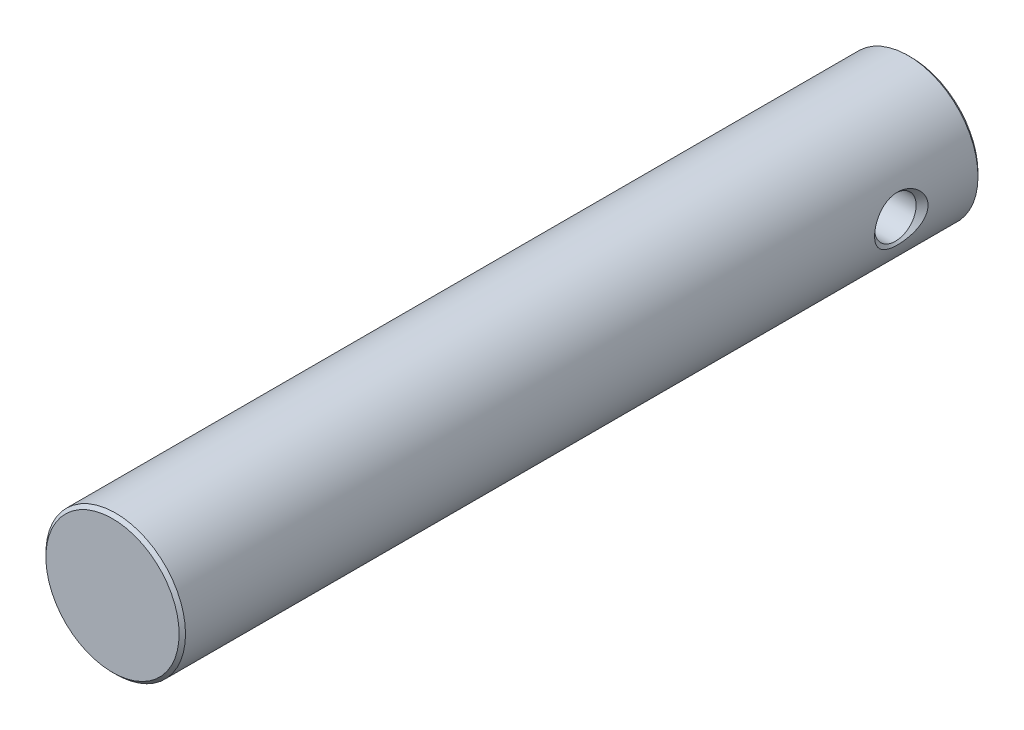
ISO-10303-21;
HEADER;
FILE_DESCRIPTION(('STEP AP214'),'2;1');
FILE_NAME('part.step','',(''),(''),'','','');
FILE_SCHEMA(('AUTOMOTIVE_DESIGN { 1 0 10303 214 1 1 1 1 }'));
ENDSEC;
DATA;
#1=APPLICATION_CONTEXT('core data for automotive mechanical design processes');
#2=APPLICATION_PROTOCOL_DEFINITION('international standard','automotive_design',2000,#1);
#3=PRODUCT_CONTEXT('',#1,'mechanical');
#4=PRODUCT('Part','Part','',(#3));
#5=PRODUCT_RELATED_PRODUCT_CATEGORY('part','',(#4));
#6=PRODUCT_DEFINITION_FORMATION('','',#4);
#7=PRODUCT_DEFINITION_CONTEXT('part definition',#1,'design');
#8=PRODUCT_DEFINITION('design','',#6,#7);
#9=PRODUCT_DEFINITION_SHAPE('','',#8);
#10=(LENGTH_UNIT() NAMED_UNIT(*) SI_UNIT(.MILLI.,.METRE.));
#11=(NAMED_UNIT(*) PLANE_ANGLE_UNIT() SI_UNIT($,.RADIAN.));
#12=(NAMED_UNIT(*) SI_UNIT($,.STERADIAN.) SOLID_ANGLE_UNIT());
#13=UNCERTAINTY_MEASURE_WITH_UNIT(LENGTH_MEASURE(1.E-05),#10,'distance_accuracy_value','');
#14=(GEOMETRIC_REPRESENTATION_CONTEXT(3) GLOBAL_UNCERTAINTY_ASSIGNED_CONTEXT((#13)) GLOBAL_UNIT_ASSIGNED_CONTEXT((#10,
#11,#12)) REPRESENTATION_CONTEXT('',''));
#15=CARTESIAN_POINT('',(0.,0.,0.));
#16=DIRECTION('',(0.,0.,1.));
#17=DIRECTION('',(1.,0.,0.));
#18=AXIS2_PLACEMENT_3D('',#15,#16,#17);
#19=CARTESIAN_POINT('',(0.,0.,-31.75));
#20=DIRECTION('',(0.,0.,1.));
#21=DIRECTION('',(1.,0.,0.));
#22=AXIS2_PLACEMENT_3D('',#19,#20,#21);
#23=CYLINDRICAL_SURFACE('',#22,5.5499);
#24=CARTESIAN_POINT('',(0.,-5.5499,14.2748));
#25=CARTESIAN_POINT('',(0.0988542584628955,-5.54989909986941,14.274800944377));
#26=CARTESIAN_POINT('',(0.197744021132447,-5.5472518584646,14.2784596493677));
#27=CARTESIAN_POINT('',(0.39475030264655,-5.53672353539861,14.2930386515627));
#28=CARTESIAN_POINT('',(0.492866252837972,-5.52883891254603,14.3039638619322));
#29=CARTESIAN_POINT('',(0.687718107793937,-5.5079985260747,14.3329355871665));
#30=CARTESIAN_POINT('',(0.784450593813109,-5.49503190124282,14.3509973549009));
#31=CARTESIAN_POINT('',(0.975627683931618,-5.46433324991178,14.3939604773847));
#32=CARTESIAN_POINT('',(1.070071244772,-5.44659909337088,14.4188648894063));
#33=CARTESIAN_POINT('',(1.34780913542737,-5.38705696081635,14.502982271891));
#34=CARTESIAN_POINT('',(1.52691208431064,-5.33875110287644,14.5718144614485));
#35=CARTESIAN_POINT('',(1.86985166359377,-5.22853596625687,14.7319717817279));
#36=CARTESIAN_POINT('',(2.03369406844376,-5.16663186305154,14.8232883565165));
#37=CARTESIAN_POINT('',(2.35851306333458,-5.02720489734093,15.0346839794055));
#38=CARTESIAN_POINT('',(2.51788456364778,-4.94877502943443,15.1566195619126));
#39=CARTESIAN_POINT('',(2.81537610405895,-4.78579690491205,15.4210950304568));
#40=CARTESIAN_POINT('',(2.95346148489604,-4.7012389925521,15.5636678024224));
#41=CARTESIAN_POINT('',(3.1556630008805,-4.56633574956764,15.8057846684316));
#42=CARTESIAN_POINT('',(3.22707834612859,-4.516011968461,15.8993528998113));
#43=CARTESIAN_POINT('',(3.36174617806854,-4.41667807584223,16.0929271750348));
#44=CARTESIAN_POINT('',(3.42499637481465,-4.36766833589789,16.1929350131546));
#45=CARTESIAN_POINT('',(3.54285314014363,-4.27262293131192,16.3990757618303));
#46=CARTESIAN_POINT('',(3.59747152455169,-4.22658325307483,16.5052000232303));
#47=CARTESIAN_POINT('',(3.69763184204563,-4.1392416860651,16.7234780882721));
#48=CARTESIAN_POINT('',(3.74317527056043,-4.09793901717482,16.8356308946178));
#49=CARTESIAN_POINT('',(3.83855480007141,-4.00905228763887,17.1055636236187));
#50=CARTESIAN_POINT('',(3.88445168028566,-3.96421669439769,17.2657366320368));
#51=CARTESIAN_POINT('',(3.93834985305575,-3.91042566184026,17.5119558875052));
#52=CARTESIAN_POINT('',(3.95382045998245,-3.89474380936618,17.5949765512204));
#53=CARTESIAN_POINT('',(3.97956164714028,-3.86843906801129,17.762604263144));
#54=CARTESIAN_POINT('',(3.98983432457849,-3.85781413891801,17.8472106572466));
#55=CARTESIAN_POINT('',(4.00503549216036,-3.84203109843311,18.0180474851989));
#56=CARTESIAN_POINT('',(4.00992399182666,-3.8369139015043,18.1042852958025));
#57=CARTESIAN_POINT('',(4.01411493889475,-3.83252931734454,18.2770452449626));
#58=CARTESIAN_POINT('',(4.01341757949694,-3.83326172779081,18.3635673735817));
#59=CARTESIAN_POINT('',(4.0064506376884,-3.84054266235966,18.5361774965497));
#60=CARTESIAN_POINT('',(4.00017849788727,-3.84709385580612,18.6222652734128));
#61=CARTESIAN_POINT('',(3.98219127656686,-3.86570932029536,18.7932999410377));
#62=CARTESIAN_POINT('',(3.97047337983136,-3.87777644277717,18.878246218297));
#63=CARTESIAN_POINT('',(3.94011055778005,-3.90863655305994,19.0563784428082));
#64=CARTESIAN_POINT('',(3.92080769937962,-3.92805862076943,19.1493432766045));
#65=CARTESIAN_POINT('',(3.87604137655076,-3.97223912897917,19.3325007531704));
#66=CARTESIAN_POINT('',(3.85057377377293,-3.9970011529309,19.4226914876747));
#67=CARTESIAN_POINT('',(3.76541570153038,-4.07788392863067,19.6887526346269));
#68=CARTESIAN_POINT('',(3.69700232179894,-4.14056622861344,19.8599288576933));
#69=CARTESIAN_POINT('',(3.56609682480957,-4.25313017200406,20.1328202827925));
#70=CARTESIAN_POINT('',(3.50931778754628,-4.30025160544126,20.2385731129106));
#71=CARTESIAN_POINT('',(3.38713184418136,-4.39713550310313,20.4437731255054));
#72=CARTESIAN_POINT('',(3.32172269463881,-4.44689865203774,20.5432186583811));
#73=CARTESIAN_POINT('',(3.1825938157913,-4.54751221164715,20.7356489468278));
#74=CARTESIAN_POINT('',(3.10886730465102,-4.59836348178154,20.8286283286979));
#75=CARTESIAN_POINT('',(2.95337964365325,-4.69973965701643,21.007814513648));
#76=CARTESIAN_POINT('',(2.87161815067056,-4.75026454808098,21.0940210272169));
#77=CARTESIAN_POINT('',(2.69925042513856,-4.85030755508015,21.2602591841581));
#78=CARTESIAN_POINT('',(2.60855130624872,-4.89980678685218,21.3402060759225));
#79=CARTESIAN_POINT('',(2.41937491257623,-4.99592552449282,21.4922349969848));
#80=CARTESIAN_POINT('',(2.32089870179697,-5.04254542274037,21.564318098945));
#81=CARTESIAN_POINT('',(2.11665181287464,-5.13162312103817,21.6998238316032));
#82=CARTESIAN_POINT('',(2.01089477461595,-5.17408836138038,21.7632620270243));
#83=CARTESIAN_POINT('',(1.79249305484912,-5.2537494320948,21.8807884800441));
#84=CARTESIAN_POINT('',(1.6798509903082,-5.29094724697889,21.9348802606216));
#85=CARTESIAN_POINT('',(1.39192633641222,-5.37550136432577,22.0567095746757));
#86=CARTESIAN_POINT('',(1.21281047063183,-5.41900626761304,22.1182990144332));
#87=CARTESIAN_POINT('',(0.844564846909833,-5.48845754796403,22.2159420107817));
#88=CARTESIAN_POINT('',(0.655442549899065,-5.51441681377834,22.2520143127725));
#89=CARTESIAN_POINT('',(0.271580440119159,-5.54660432288356,22.2966719065854));
#90=CARTESIAN_POINT('',(0.0768233695225006,-5.55276359145286,22.3051611117964));
#91=CARTESIAN_POINT('',(-0.311427606468222,-5.54455684607664,22.2938095233789));
#92=CARTESIAN_POINT('',(-0.504921429237453,-5.53018950280081,22.2739668949438));
#93=CARTESIAN_POINT('',(-0.874454762639378,-5.48357367867249,22.2090248971509));
#94=CARTESIAN_POINT('',(-1.05087441712138,-5.45232196756823,22.165332156403));
#95=CARTESIAN_POINT('',(-1.39324914866746,-5.37504244161861,22.0558857586081));
#96=CARTESIAN_POINT('',(-1.559202059502,-5.32901157996283,21.9901275525071));
#97=CARTESIAN_POINT('',(-1.89165332423962,-5.2207451139705,21.832590820731));
#98=CARTESIAN_POINT('',(-2.05697158009923,-5.15745645898042,21.7390610957695));
#99=CARTESIAN_POINT('',(-2.37016352064494,-5.02124851328564,21.5319797428113));
#100=CARTESIAN_POINT('',(-2.51802483245185,-4.94832246860068,21.4184140545355));
#101=CARTESIAN_POINT('',(-2.82051998340972,-4.78339459538117,21.1512646636168));
#102=CARTESIAN_POINT('',(-2.97147042542011,-4.69033947945335,20.9941599602924));
#103=CARTESIAN_POINT('',(-3.24632307325338,-4.50447449482305,20.6574819724768));
#104=CARTESIAN_POINT('',(-3.3702057999097,-4.41166484991227,20.4778926522689));
#105=CARTESIAN_POINT('',(-3.57437937549706,-4.24735586993741,20.1226170570111));
#106=CARTESIAN_POINT('',(-3.65827016904424,-4.17466198503174,19.9495622350248));
#107=CARTESIAN_POINT('',(-3.80164913566819,-4.04453285891094,19.5883124357241));
#108=CARTESIAN_POINT('',(-3.86118859213625,-3.98706564155013,19.400150285047));
#109=CARTESIAN_POINT('',(-3.94309896125019,-3.90589386132974,19.051454075068));
#110=CARTESIAN_POINT('',(-3.97059771535183,-3.87767467617476,18.8932045605753));
#111=CARTESIAN_POINT('',(-4.00635298469629,-3.84073302564279,18.5723766266053));
#112=CARTESIAN_POINT('',(-4.01463507946308,-3.83198464308241,18.4098042534174));
#113=CARTESIAN_POINT('',(-4.01135350478794,-3.83541825974806,18.0849292539801));
#114=CARTESIAN_POINT('',(-3.99976965375334,-3.84762154355225,17.9226270699045));
#115=CARTESIAN_POINT('',(-3.95760708300469,-3.8909645912754,17.6030145692194));
#116=CARTESIAN_POINT('',(-3.92699848353486,-3.92213414147838,17.445712514966));
#117=CARTESIAN_POINT('',(-3.83613536286259,-4.01131331124118,17.090835299189));
#118=CARTESIAN_POINT('',(-3.76956610553841,-4.07469405833083,16.896259086088));
#119=CARTESIAN_POINT('',(-3.61041709375455,-4.21634977903148,16.5239612241513));
#120=CARTESIAN_POINT('',(-3.51779366264744,-4.29464969107614,16.3462685534829));
#121=CARTESIAN_POINT('',(-3.30600752038752,-4.45985279020995,16.0037563030462));
#122=CARTESIAN_POINT('',(-3.18616041794617,-4.54693820404395,15.8394514656539));
#123=CARTESIAN_POINT('',(-2.92281130702149,-4.72053310680361,15.5304404487209));
#124=CARTESIAN_POINT('',(-2.77930022834999,-4.80704236161344,15.3857418229562));
#125=CARTESIAN_POINT('',(-2.53146209291151,-4.94007027443387,15.171492566076));
#126=CARTESIAN_POINT('',(-2.43427593732761,-4.98880046498551,15.0949556948391));
#127=CARTESIAN_POINT('',(-2.23204817944987,-5.08249435213028,14.950461160733));
#128=CARTESIAN_POINT('',(-2.12701010007382,-5.12745971891306,14.8824996867005));
#129=CARTESIAN_POINT('',(-1.90957819908447,-5.2123427429723,14.7559898164576));
#130=CARTESIAN_POINT('',(-1.79718943395093,-5.25226381589277,14.6974350433151));
#131=CARTESIAN_POINT('',(-1.56569547144015,-5.32585346341179,14.5906227167325));
#132=CARTESIAN_POINT('',(-1.44659382991463,-5.35952530843067,14.542359775267));
#133=CARTESIAN_POINT('',(-1.23729808008295,-5.41096890092587,14.4691733356683));
#134=CARTESIAN_POINT('',(-1.14849211758806,-5.43054113607316,14.4415132522572));
#135=CARTESIAN_POINT('',(-0.968416235918972,-5.46552508374404,14.3922780198637));
#136=CARTESIAN_POINT('',(-0.877146940431933,-5.48093783872867,14.3707013461786));
#137=CARTESIAN_POINT('',(-0.692941384882553,-5.50725504094046,14.3339633370566));
#138=CARTESIAN_POINT('',(-0.600010118119875,-5.51817119277971,14.3187853434729));
#139=CARTESIAN_POINT('',(-0.412918736977421,-5.5353140125568,14.2949868210681));
#140=CARTESIAN_POINT('',(-0.318759371259146,-5.5415434130513,14.2863624711906));
#141=CARTESIAN_POINT('',(-0.187012416860984,-5.54687438395354,14.2789850352275));
#142=CARTESIAN_POINT('',(-0.149640149707313,-5.54800834172257,14.2774163329913));
#143=CARTESIAN_POINT('',(-0.0748469548506951,-5.54952136447578,14.275323575254));
#144=CARTESIAN_POINT('',(-0.0374260219483874,-5.54990034078762,14.2747996424608));
#145=CARTESIAN_POINT('',(0.,-5.5499,14.2748));
#146=B_SPLINE_CURVE_WITH_KNOTS('',3,(#24,#25,#26,#27,#28,#29,#30,#31,#32,#33,#34,#35,#36,#37,
#38,#39,#40,#41,#42,#43,#44,#45,#46,#47,#48,#49,#50,#51,#52,#53,#54,#55,#56,#57,#58,#59,#60,#61,
#62,#63,#64,#65,#66,#67,#68,#69,#70,#71,#72,#73,#74,#75,#76,#77,#78,#79,#80,#81,#82,#83,#84,#85,
#86,#87,#88,#89,#90,#91,#92,#93,#94,#95,#96,#97,#98,#99,#100,#101,#102,#103,#104,#105,#106,#107,
#108,#109,#110,#111,#112,#113,#114,#115,#116,#117,#118,#119,#120,#121,#122,#123,#124,#125,#126,
#127,#128,#129,#130,#131,#132,#133,#134,#135,#136,#137,#138,#139,#140,#141,#142,#143,#144,#145),
.UNSPECIFIED.,.T.,.F.,(4,2,2,2,2,2,2,2,2,2,2,2,2,2,2,2,2,2,2,2,2,2,2,2,2,2,2,2,2,2,2,2,2,2,2,2,
2,2,2,2,2,2,2,2,2,2,2,2,2,2,2,2,2,2,2,2,2,2,2,2,4),(0.,0.296521574776071,0.593243843342591,
0.890603753006894,1.18809673880865,1.77885849847819,2.36939580336754,3.01344611735805,
3.65853427865239,4.04221064201519,4.42599437612411,4.80924812288612,5.19243866233522,
5.70782126896884,5.96523904642418,6.22255288062312,6.48176526391517,6.74096868176122,
7.00029106871723,7.25974766328952,7.55005162633002,7.84055101146711,8.42211051405519,
8.80857081902133,9.19513178494655,9.58201025586363,9.96890525519256,10.3603601828925,
10.7517616471358,11.1424488295771,11.5329884260675,12.1133670512671,12.6933188747036,
13.2752888252278,13.8572964665977,14.4081964935623,14.9592101648693,15.5576035017297,
16.1564184448791,16.8644495623267,17.5729885452968,18.1877160164013,18.801142134598,
19.288312180541,19.7748333756878,20.2618491151148,20.7496316878477,21.3916993917568,
22.0348499250643,22.6964287904467,23.3582618249916,23.7566552170161,24.1548709227453,
24.5528155228779,24.950551275017,25.2354161283391,25.5202095215596,25.804256843243,
26.0881384257782,26.2003877102874,26.3126501776641),.UNSPECIFIED.);
#147=CARTESIAN_POINT('',(0.,-5.5499,14.2748));
#148=VERTEX_POINT('',#147);
#149=EDGE_CURVE('E11',#148,#148,#146,.T.);
#150=ORIENTED_EDGE('',*,*,#149,.F.);
#151=EDGE_LOOP('',(#150));
#152=FACE_BOUND('',#151,.T.);
#153=CARTESIAN_POINT('',(0.,0.,31.496));
#154=DIRECTION('',(0.,0.,1.));
#155=DIRECTION('',(1.,0.,0.));
#156=AXIS2_PLACEMENT_3D('',#153,#154,#155);
#157=CIRCLE('',#156,5.5499);
#158=CARTESIAN_POINT('',(5.5499,0.,31.496));
#159=VERTEX_POINT('',#158);
#160=EDGE_CURVE('E27',#159,#159,#157,.F.);
#161=ORIENTED_EDGE('',*,*,#160,.T.);
#162=EDGE_LOOP('',(#161));
#163=FACE_BOUND('',#162,.T.);
#164=CARTESIAN_POINT('',(0.,0.,-31.496));
#165=DIRECTION('',(0.,0.,1.));
#166=DIRECTION('',(1.,0.,0.));
#167=AXIS2_PLACEMENT_3D('',#164,#165,#166);
#168=CIRCLE('',#167,5.5499);
#169=CARTESIAN_POINT('',(5.5499,0.,-31.496));
#170=VERTEX_POINT('',#169);
#171=EDGE_CURVE('E54',#170,#170,#168,.T.);
#172=ORIENTED_EDGE('',*,*,#171,.T.);
#173=EDGE_LOOP('',(#172));
#174=FACE_BOUND('',#173,.T.);
#175=CARTESIAN_POINT('',(5.35379022939372,-1.46229962375991,-26.6566786446898));
#176=CARTESIAN_POINT('',(5.33549327363893,-1.52929619797754,-26.5506362719607));
#177=CARTESIAN_POINT('',(5.31833083866429,-1.58723207768655,-26.438464771529));
#178=CARTESIAN_POINT('',(5.28840888501346,-1.68425574927919,-26.2054600936719));
#179=CARTESIAN_POINT('',(5.27566213057231,-1.72328902746247,-26.084603005226));
#180=CARTESIAN_POINT('',(5.25613793004653,-1.78195669587375,-25.8373192664702));
#181=CARTESIAN_POINT('',(5.24938197872293,-1.80152126357239,-25.7108742561494));
#182=CARTESIAN_POINT('',(5.24277073596635,-1.82067302337714,-25.4564133528529));
#183=CARTESIAN_POINT('',(5.24290992741283,-1.8202761875155,-25.3283987977439));
#184=CARTESIAN_POINT('',(5.2501263859595,-1.79935763626881,-25.0717471466724));
#185=CARTESIAN_POINT('',(5.25733623415469,-1.77845134795399,-24.9431449317666));
#186=CARTESIAN_POINT('',(5.27796710887384,-1.71625085821309,-24.6913882195294));
#187=CARTESIAN_POINT('',(5.29139239845373,-1.67494266219576,-24.5682375249131));
#188=CARTESIAN_POINT('',(5.32271973392227,-1.57254616815927,-24.3312536183247));
#189=CARTESIAN_POINT('',(5.34061545791379,-1.51148576719846,-24.2174075473577));
#190=CARTESIAN_POINT('',(5.37858911287341,-1.37021745352902,-24.002705431944));
#191=CARTESIAN_POINT('',(5.39866473097481,-1.29002972882518,-23.9018358630342));
#192=CARTESIAN_POINT('',(5.43393726311979,-1.13085660452914,-23.7374449001199));
#193=CARTESIAN_POINT('',(5.44925050038109,-1.05536004154897,-23.6705638346178));
#194=CARTESIAN_POINT('',(5.47801500349811,-0.894108777405574,-23.5499982825102));
#195=CARTESIAN_POINT('',(5.49146733669441,-0.808360009560677,-23.496306217394));
#196=CARTESIAN_POINT('',(5.51507075182213,-0.627494991354507,-23.404511746994));
#197=CARTESIAN_POINT('',(5.52519467771054,-0.532309550466073,-23.3665369577378));
#198=CARTESIAN_POINT('',(5.54058580391635,-0.336058172327269,-23.3095002335432));
#199=CARTESIAN_POINT('',(5.54585825551444,-0.234998719477542,-23.2904178475886));
#200=CARTESIAN_POINT('',(5.55041545718603,-0.0451086707256445,-23.2739219000482));
#201=CARTESIAN_POINT('',(5.55042659968706,0.0434832081315005,-23.2738796428403));
#202=CARTESIAN_POINT('',(5.54626346651213,0.219251673509871,-23.288952916722));
#203=CARTESIAN_POINT('',(5.54208994296223,0.306428511500549,-23.3040657239339));
#204=CARTESIAN_POINT('',(5.53033990961621,0.472591831216115,-23.3473963576569));
#205=CARTESIAN_POINT('',(5.5229396544745,0.551770374678918,-23.3749377126414));
#206=CARTESIAN_POINT('',(5.50550399562357,0.704808592561448,-23.4414921979298));
#207=CARTESIAN_POINT('',(5.49546797250045,0.778667011529129,-23.48050802503));
#208=CARTESIAN_POINT('',(5.47257374119371,0.926521239186651,-23.5725922145181));
#209=CARTESIAN_POINT('',(5.45953907509057,0.999879536384363,-23.6266357009233));
#210=CARTESIAN_POINT('',(5.43244849105793,1.13791533438083,-23.7446175147449));
#211=CARTESIAN_POINT('',(5.41839201588815,1.20258804294695,-23.8085612630406));
#212=CARTESIAN_POINT('',(5.38802568281378,1.33256488198384,-23.9557346500257));
#213=CARTESIAN_POINT('',(5.37172387014579,1.39623717294969,-24.0404076730647));
#214=CARTESIAN_POINT('',(5.3406910631579,1.5106041270004,-24.2183666331363));
#215=CARTESIAN_POINT('',(5.32596101744019,1.56129097859578,-24.3116577087328));
#216=CARTESIAN_POINT('',(5.29746364823888,1.65561056763695,-24.51855755623));
#217=CARTESIAN_POINT('',(5.28413510690372,1.6971984953742,-24.6331641746804));
#218=CARTESIAN_POINT('',(5.26273047742668,1.76245269942539,-24.8678391059931));
#219=CARTESIAN_POINT('',(5.2546556940651,1.78611452399884,-24.9879087676966));
#220=CARTESIAN_POINT('',(5.24439599758965,1.8160342959794,-25.2375939894795));
#221=CARTESIAN_POINT('',(5.24258199481482,1.82119692075109,-25.3673579160285));
#222=CARTESIAN_POINT('',(5.24611970045705,1.81097829347803,-25.6259760877576));
#223=CARTESIAN_POINT('',(5.25147194469494,1.79559550525144,-25.7548302641913));
#224=CARTESIAN_POINT('',(5.2686939982303,1.74441417517717,-26.0086465909513));
#225=CARTESIAN_POINT('',(5.28059625118705,1.70851397160481,-26.1335860680951));
#226=CARTESIAN_POINT('',(5.30942985275612,1.61667882796526,-26.3753704271073));
#227=CARTESIAN_POINT('',(5.32636425693971,1.56073171095613,-26.492210337525));
#228=CARTESIAN_POINT('',(5.36291201615376,1.4300764231388,-26.7128841751448));
#229=CARTESIAN_POINT('',(5.38249730356282,1.35555872037637,-26.8168350064005));
#230=CARTESIAN_POINT('',(5.42186220785225,1.18833116235064,-27.0088275920365));
#231=CARTESIAN_POINT('',(5.44164143627343,1.09565255493186,-27.0968961806728));
#232=CARTESIAN_POINT('',(5.47352647430681,0.920634752421233,-27.2315641310224));
#233=CARTESIAN_POINT('',(5.48627462352337,0.842093129701373,-27.2829642630428));
#234=CARTESIAN_POINT('',(5.50903815297959,0.677333414019524,-27.3723545039522));
#235=CARTESIAN_POINT('',(5.51905574453934,0.591121608200776,-27.4103554714133));
#236=CARTESIAN_POINT('',(5.53528227085293,0.412457590241002,-27.4710224257562));
#237=CARTESIAN_POINT('',(5.54146730461751,0.319970130168582,-27.4935922678959));
#238=CARTESIAN_POINT('',(5.54911767286699,0.132229965240443,-27.5214206576247));
#239=CARTESIAN_POINT('',(5.55058535249246,0.0369786581493264,-27.5266878069387));
#240=CARTESIAN_POINT('',(5.54871412734196,-0.142829006194917,-27.5199192432099));
#241=CARTESIAN_POINT('',(5.54586168703121,-0.227462400127607,-27.5096348945797));
#242=CARTESIAN_POINT('',(5.53654279623233,-0.393722685472211,-27.4755362343266));
#243=CARTESIAN_POINT('',(5.53007652086985,-0.475349722367234,-27.45172257833));
#244=CARTESIAN_POINT('',(5.51414115685376,-0.63407186946161,-27.3916710814404));
#245=CARTESIAN_POINT('',(5.50465511392806,-0.711138405468389,-27.3553629958972));
#246=CARTESIAN_POINT('',(5.48354727256935,-0.858883368240898,-27.2719457316895));
#247=CARTESIAN_POINT('',(5.47192381506011,-0.929556768590856,-27.2248281555397));
#248=CARTESIAN_POINT('',(5.44588843688452,-1.07219582428704,-27.1147955691486));
#249=CARTESIAN_POINT('',(5.43131012518132,-1.14316080876864,-27.0506286607584));
#250=CARTESIAN_POINT('',(5.40189212313105,-1.27495603645967,-26.9128475645728));
#251=CARTESIAN_POINT('',(5.38705277727754,-1.33579866960733,-26.8392451244546));
#252=CARTESIAN_POINT('',(5.36626778178028,-1.41605282357577,-26.7275472904038));
#253=CARTESIAN_POINT('',(5.35996441282733,-1.43969208487818,-26.6924619230526));
#254=CARTESIAN_POINT('',(5.35379022939372,-1.46229962375991,-26.6566786446898));
#255=B_SPLINE_CURVE_WITH_KNOTS('',3,(#175,#176,#177,#178,#179,#180,#181,#182,#183,#184,#185,
#186,#187,#188,#189,#190,#191,#192,#193,#194,#195,#196,#197,#198,#199,#200,#201,#202,#203,#204,
#205,#206,#207,#208,#209,#210,#211,#212,#213,#214,#215,#216,#217,#218,#219,#220,#221,#222,#223,
#224,#225,#226,#227,#228,#229,#230,#231,#232,#233,#234,#235,#236,#237,#238,#239,#240,#241,#242,
#243,#244,#245,#246,#247,#248,#249,#250,#251,#252,#253,#254),.UNSPECIFIED.,.T.,.F.,(4,2,2,2,2,2,
2,2,2,2,2,2,2,2,2,2,2,2,2,2,2,2,2,2,2,2,2,2,2,2,2,2,2,2,2,2,2,2,2,4),(0.,0.380160786026919,
0.761411493376816,1.14402464182552,1.52633164886305,1.91594704092403,2.30583005975914,
2.69516481341106,3.08409044647434,3.38892327696316,3.69358053603518,4.00066509594349,
4.30741687232953,4.57180318297381,4.83614198297069,5.08756371205216,5.33904457899637,
5.61412461066401,5.88935579832118,6.20967078089147,6.53017800129911,6.89651144741853,
7.26293583842021,7.65072736296093,8.03854788432215,8.42830688673215,8.81830303990172,
9.20445294950542,9.58994418882132,9.8729908924455,10.1558076873063,10.4403709158958,
10.7247926575297,10.9794794438693,11.2341538892131,11.4902841807869,11.7466141281833,
12.0358786565715,12.3247864727265,12.4530691476509),.UNSPECIFIED.);
#256=CARTESIAN_POINT('',(5.35379022939372,-1.46229962375991,-26.6566786446898));
#257=VERTEX_POINT('',#256);
#258=EDGE_CURVE('E48',#257,#257,#255,.T.);
#259=ORIENTED_EDGE('',*,*,#258,.T.);
#260=EDGE_LOOP('',(#259));
#261=FACE_BOUND('',#260,.T.);
#262=CARTESIAN_POINT('',(-5.35379022939372,-1.46229962375991,-26.6566786446898));
#263=CARTESIAN_POINT('',(-5.37061597259678,-1.40070089396391,-26.7541686346161));
#264=CARTESIAN_POINT('',(-5.38843841776079,-1.33130167217859,-26.8467135259745));
#265=CARTESIAN_POINT('',(-5.42410907662181,-1.17755797264617,-27.0186467893533));
#266=CARTESIAN_POINT('',(-5.44195729963057,-1.09320254781124,-27.0980254415018));
#267=CARTESIAN_POINT('',(-5.47228340919388,-0.927989276659826,-27.2264665831272));
#268=CARTESIAN_POINT('',(-5.4851400601992,-0.849456000512901,-27.2784229629951));
#269=CARTESIAN_POINT('',(-5.50813566258748,-0.684639487288666,-27.3688893706026));
#270=CARTESIAN_POINT('',(-5.51827735235485,-0.598364177243069,-27.4074129589831));
#271=CARTESIAN_POINT('',(-5.53475873862249,-0.419453752596544,-27.4690955037132));
#272=CARTESIAN_POINT('',(-5.54107387394885,-0.326781719246114,-27.4921553026501));
#273=CARTESIAN_POINT('',(-5.54896680611925,-0.138575976870264,-27.5208776461942));
#274=CARTESIAN_POINT('',(-5.55054696355573,-0.0430437177930994,-27.5265488598004));
#275=CARTESIAN_POINT('',(-5.54885840292978,0.137161718597492,-27.5204408613158));
#276=CARTESIAN_POINT('',(-5.54608872701979,0.221906659315005,-27.5104578090416));
#277=CARTESIAN_POINT('',(-5.53691789539994,0.388440986296028,-27.4769160371855));
#278=CARTESIAN_POINT('',(-5.53051661436326,0.47023027045611,-27.4533568490903));
#279=CARTESIAN_POINT('',(-5.51470180297556,0.62918337535976,-27.3938064703627));
#280=CARTESIAN_POINT('',(-5.50527573890832,0.70632633503514,-27.3577635008038));
#281=CARTESIAN_POINT('',(-5.48427604646974,0.854222159542308,-27.2748746391754));
#282=CARTESIAN_POINT('',(-5.47270167595328,0.924972803515029,-27.2280250125207));
#283=CARTESIAN_POINT('',(-5.4467711177048,1.06770122142384,-27.1186217069833));
#284=CARTESIAN_POINT('',(-5.4322482900183,1.13869716279293,-27.0548300397098));
#285=CARTESIAN_POINT('',(-5.40289433177512,1.27071031943866,-26.9177214046366));
#286=CARTESIAN_POINT('',(-5.38806301929836,1.33172144692846,-26.8443986742202));
#287=CARTESIAN_POINT('',(-5.35683555919981,1.45266533457341,-26.677160637219));
#288=CARTESIAN_POINT('',(-5.34059208304249,1.51071413556012,-26.5818516924437));
#289=CARTESIAN_POINT('',(-5.3108480437364,1.61216646889232,-26.3833360321945));
#290=CARTESIAN_POINT('',(-5.2973489105415,1.65556237401489,-26.2801252377796));
#291=CARTESIAN_POINT('',(-5.27303550717413,1.73155395565542,-26.0556383074536));
#292=CARTESIAN_POINT('',(-5.26272562696637,1.76227234343337,-25.9336671552121));
#293=CARTESIAN_POINT('',(-5.24840315426707,1.80448133513701,-25.6860857561682));
#294=CARTESIAN_POINT('',(-5.24439140676173,1.81596935904309,-25.5604750233652));
#295=CARTESIAN_POINT('',(-5.24313738165197,1.81959118331666,-25.3047920768329));
#296=CARTESIAN_POINT('',(-5.24612190379079,1.81107653314775,-25.1747089032406));
#297=CARTESIAN_POINT('',(-5.25895078030302,1.77347475525956,-24.9178818464851));
#298=CARTESIAN_POINT('',(-5.26879619993013,1.74438443285867,-24.791138485048));
#299=CARTESIAN_POINT('',(-5.29409367306687,1.66602867403189,-24.5445005562418));
#300=CARTESIAN_POINT('',(-5.30955074227459,1.61674518384845,-24.4246122272175));
#301=CARTESIAN_POINT('',(-5.34411825935842,1.49852315609707,-24.1953719517546));
#302=CARTESIAN_POINT('',(-5.36323075056808,1.42957361482018,-24.0860259500041));
#303=CARTESIAN_POINT('',(-5.40204514765463,1.27494111474851,-23.8848123538895));
#304=CARTESIAN_POINT('',(-5.42171609233317,1.18977419663341,-23.7925447185357));
#305=CARTESIAN_POINT('',(-5.45938018181902,1.00278236371575,-23.6264389728936));
#306=CARTESIAN_POINT('',(-5.47737713703379,0.900996809632796,-23.552558332783));
#307=CARTESIAN_POINT('',(-5.50416372455153,0.715278949366272,-23.4465004667387));
#308=CARTESIAN_POINT('',(-5.51410627541712,0.63484777809182,-23.4084464906737));
#309=CARTESIAN_POINT('',(-5.53071441812676,0.468554201985367,-23.3458879995812));
#310=CARTESIAN_POINT('',(-5.53738280114853,0.382696493925963,-23.3213719414564));
#311=CARTESIAN_POINT('',(-5.54671731724316,0.207459987562593,-23.2872565470588));
#312=CARTESIAN_POINT('',(-5.5493671155429,0.118068325782939,-23.2777180863103));
#313=CARTESIAN_POINT('',(-5.5502863570535,-0.0610347468998624,-23.2743960139389));
#314=CARTESIAN_POINT('',(-5.54855610183075,-0.150746135365182,-23.2806113176706));
#315=CARTESIAN_POINT('',(-5.54118497653846,-0.321730458142372,-23.3074456872782));
#316=CARTESIAN_POINT('',(-5.5358080495608,-0.403170926164888,-23.327093263683));
#317=CARTESIAN_POINT('',(-5.5219709089516,-0.561756297929699,-23.3786830010606));
#318=CARTESIAN_POINT('',(-5.51351016701717,-0.638900463040043,-23.4106272686901));
#319=CARTESIAN_POINT('',(-5.49373346188155,-0.791542128774935,-23.4874477199589));
#320=CARTESIAN_POINT('',(-5.48228436520301,-0.866706709212296,-23.5329468054644));
#321=CARTESIAN_POINT('',(-5.45780630167227,-1.00945326544158,-23.6342113142377));
#322=CARTESIAN_POINT('',(-5.44477661659517,-1.07703176703556,-23.6899814106985));
#323=CARTESIAN_POINT('',(-5.41610963001385,-1.21355938810949,-23.8192033569072));
#324=CARTESIAN_POINT('',(-5.40037647576126,-1.28116307542656,-23.8940540245343));
#325=CARTESIAN_POINT('',(-5.36953121160412,-1.40484668904689,-24.0528469840772));
#326=CARTESIAN_POINT('',(-5.3544195088077,-1.460919154596,-24.1367951087986));
#327=CARTESIAN_POINT('',(-5.32380030447835,-1.56913920130247,-24.3257571934285));
#328=CARTESIAN_POINT('',(-5.30861231318745,-1.61924316834772,-24.4319978131998));
#329=CARTESIAN_POINT('',(-5.28234561112396,-1.70298052793116,-24.6512501628245));
#330=CARTESIAN_POINT('',(-5.27126802128989,-1.73660942839,-24.7642637299682));
#331=CARTESIAN_POINT('',(-5.25367361726776,-1.78917725525588,-25.0042582633689));
#332=CARTESIAN_POINT('',(-5.24762853289422,-1.80661180872966,-25.1316066162407));
#333=CARTESIAN_POINT('',(-5.24253925343759,-1.82132698099991,-25.3876757445326));
#334=CARTESIAN_POINT('',(-5.24349955627253,-1.81859465132155,-25.5163973487071));
#335=CARTESIAN_POINT('',(-5.25236918239516,-1.79281774137108,-25.7734682353136));
#336=CARTESIAN_POINT('',(-5.26038153120211,-1.76947199711389,-25.9017835758763));
#337=CARTESIAN_POINT('',(-5.28245272900544,-1.7024447413716,-26.1522475430638));
#338=CARTESIAN_POINT('',(-5.29649864384,-1.65880671405222,-26.274408739978));
#339=CARTESIAN_POINT('',(-5.3189474548291,-1.58450334752727,-26.4374323683448));
#340=CARTESIAN_POINT('',(-5.32557194176706,-1.56214193664093,-26.4824652416229));
#341=CARTESIAN_POINT('',(-5.33933128785037,-1.51444694555863,-26.5708710223574));
#342=CARTESIAN_POINT('',(-5.34646633716578,-1.48911225562756,-26.6142433019589));
#343=CARTESIAN_POINT('',(-5.35379022939372,-1.46229962375991,-26.6566786446898));
#344=B_SPLINE_CURVE_WITH_KNOTS('',3,(#262,#263,#264,#265,#266,#267,#268,#269,#270,#271,#272,
#273,#274,#275,#276,#277,#278,#279,#280,#281,#282,#283,#284,#285,#286,#287,#288,#289,#290,#291,
#292,#293,#294,#295,#296,#297,#298,#299,#300,#301,#302,#303,#304,#305,#306,#307,#308,#309,#310,
#311,#312,#313,#314,#315,#316,#317,#318,#319,#320,#321,#322,#323,#324,#325,#326,#327,#328,#329,
#330,#331,#332,#333,#334,#335,#336,#337,#338,#339,#340,#341,#342,#343),.UNSPECIFIED.,.T.,.F.,(4,
2,2,2,2,2,2,2,2,2,2,2,2,2,2,2,2,2,2,2,2,2,2,2,2,2,2,2,2,2,2,2,2,2,2,2,2,2,2,2,4),(0.,
0.34944434510928,0.699145527477797,0.983094749157621,1.26675648347375,1.5522201610134,
1.83754149879558,2.09244073733405,2.34734877298909,2.6033270077581,2.85939383685856,
3.14792820587677,3.43663784545539,3.77359337074703,4.11072402095663,4.48761392929817,
4.86455439858834,5.25388237291361,5.64327080951748,6.03300814221556,6.42296397315247,
6.80212522407158,7.18040113462223,7.44789699570358,7.71516442303427,7.98351535630503,
8.2518478141351,8.50258020189633,8.75335556401035,9.01814464852297,9.28305450803293,
9.58812596124745,9.89339418038559,10.247227955343,10.6011581527336,10.9853934310232,
11.3698754352639,11.7600694603282,12.1494311679631,12.3014800120702,12.4535857878659),.UNSPECIFIED.);
#345=CARTESIAN_POINT('',(-5.35379022939372,-1.46229962375991,-26.6566786446898));
#346=VERTEX_POINT('',#345);
#347=EDGE_CURVE('E47',#346,#346,#344,.T.);
#348=ORIENTED_EDGE('',*,*,#347,.T.);
#349=EDGE_LOOP('',(#348));
#350=FACE_BOUND('',#349,.T.);
#351=ADVANCED_FACE('F16',(#152,#163,#174,#261,#350),#23,.T.);
#352=CARTESIAN_POINT('',(0.,0.,-31.75));
#353=DIRECTION('',(0.,0.,1.));
#354=DIRECTION('',(1.,0.,0.));
#355=AXIS2_PLACEMENT_3D('',#352,#353,#354);
#356=PLANE('',#355);
#357=CARTESIAN_POINT('',(0.,0.,-31.75));
#358=DIRECTION('',(0.,0.,1.));
#359=DIRECTION('',(1.,0.,0.));
#360=AXIS2_PLACEMENT_3D('',#357,#358,#359);
#361=CIRCLE('',#360,5.29589999999999);
#362=CARTESIAN_POINT('',(5.29589999999999,0.,-31.75));
#363=VERTEX_POINT('',#362);
#364=EDGE_CURVE('E83',#363,#363,#361,.F.);
#365=ORIENTED_EDGE('',*,*,#364,.T.);
#366=EDGE_LOOP('',(#365));
#367=FACE_BOUND('',#366,.T.);
#368=ADVANCED_FACE('F71',(#367),#356,.F.);
#369=CARTESIAN_POINT('',(0.,0.,31.75));
#370=DIRECTION('',(0.,0.,1.));
#371=DIRECTION('',(1.,0.,0.));
#372=AXIS2_PLACEMENT_3D('',#369,#370,#371);
#373=PLANE('',#372);
#374=CARTESIAN_POINT('',(0.,0.,31.75));
#375=DIRECTION('',(0.,0.,1.));
#376=DIRECTION('',(1.,0.,0.));
#377=AXIS2_PLACEMENT_3D('',#374,#375,#376);
#378=CIRCLE('',#377,5.29590000000001);
#379=CARTESIAN_POINT('',(5.29590000000001,0.,31.75));
#380=VERTEX_POINT('',#379);
#381=EDGE_CURVE('E85',#380,#380,#378,.T.);
#382=ORIENTED_EDGE('',*,*,#381,.T.);
#383=EDGE_LOOP('',(#382));
#384=FACE_BOUND('',#383,.T.);
#385=ADVANCED_FACE('F66',(#384),#373,.T.);
#386=CARTESIAN_POINT('',(3.42569235696408,0.,-25.4));
#387=DIRECTION('',(1.,0.,0.));
#388=DIRECTION('',(0.,0.,-1.));
#389=AXIS2_PLACEMENT_3D('',#386,#387,#388);
#390=CONICAL_SURFACE('',#389,0.,0.785398163397448);
#391=CARTESIAN_POINT('',(5.07669235696408,0.,-25.4));
#392=DIRECTION('',(1.,0.,0.));
#393=DIRECTION('',(0.,0.,-1.));
#394=AXIS2_PLACEMENT_3D('',#391,#392,#393);
#395=CIRCLE('',#394,1.651);
#396=CARTESIAN_POINT('',(5.07669235696408,0.,-27.051));
#397=VERTEX_POINT('',#396);
#398=EDGE_CURVE('E43',#397,#397,#395,.T.);
#399=ORIENTED_EDGE('',*,*,#398,.F.);
#400=EDGE_LOOP('',(#399));
#401=FACE_BOUND('',#400,.T.);
#402=ORIENTED_EDGE('',*,*,#258,.F.);
#403=EDGE_LOOP('',(#402));
#404=FACE_BOUND('',#403,.T.);
#405=ADVANCED_FACE('F61',(#401,#404),#390,.F.);
#406=CARTESIAN_POINT('',(-5.58469235696409,0.,-25.4));
#407=DIRECTION('',(-1.,0.,0.));
#408=DIRECTION('',(0.,0.,1.));
#409=AXIS2_PLACEMENT_3D('',#406,#407,#408);
#410=CONICAL_SURFACE('',#409,2.159,0.785398163397448);
#411=CARTESIAN_POINT('',(-5.07669235696408,0.,-25.4));
#412=DIRECTION('',(-1.,0.,0.));
#413=DIRECTION('',(0.,0.,1.));
#414=AXIS2_PLACEMENT_3D('',#411,#412,#413);
#415=CIRCLE('',#414,1.651);
#416=CARTESIAN_POINT('',(-5.07669235696408,0.,-23.749));
#417=VERTEX_POINT('',#416);
#418=EDGE_CURVE('E40',#417,#417,#415,.T.);
#419=ORIENTED_EDGE('',*,*,#418,.F.);
#420=EDGE_LOOP('',(#419));
#421=FACE_BOUND('',#420,.T.);
#422=ORIENTED_EDGE('',*,*,#347,.F.);
#423=EDGE_LOOP('',(#422));
#424=FACE_BOUND('',#423,.T.);
#425=ADVANCED_FACE('F65',(#421,#424),#410,.F.);
#426=CARTESIAN_POINT('',(0.,0.,-31.496));
#427=DIRECTION('',(0.,0.,1.));
#428=DIRECTION('',(1.,0.,0.));
#429=AXIS2_PLACEMENT_3D('',#426,#427,#428);
#430=CONICAL_SURFACE('',#429,5.5499,0.785398163397428);
#431=ORIENTED_EDGE('',*,*,#364,.F.);
#432=EDGE_LOOP('',(#431));
#433=FACE_BOUND('',#432,.T.);
#434=ORIENTED_EDGE('',*,*,#171,.F.);
#435=EDGE_LOOP('',(#434));
#436=FACE_BOUND('',#435,.T.);
#437=ADVANCED_FACE('F98',(#433,#436),#430,.T.);
#438=CARTESIAN_POINT('',(0.,0.,31.75));
#439=DIRECTION('',(0.,0.,-1.));
#440=DIRECTION('',(-1.,0.,0.));
#441=AXIS2_PLACEMENT_3D('',#438,#439,#440);
#442=CONICAL_SURFACE('',#441,5.29590000000001,0.785398163397455);
#443=ORIENTED_EDGE('',*,*,#160,.F.);
#444=EDGE_LOOP('',(#443));
#445=FACE_BOUND('',#444,.T.);
#446=ORIENTED_EDGE('',*,*,#381,.F.);
#447=EDGE_LOOP('',(#446));
#448=FACE_BOUND('',#447,.T.);
#449=ADVANCED_FACE('F18',(#445,#448),#442,.T.);
#450=CARTESIAN_POINT('',(-5.5499,0.,-25.4));
#451=DIRECTION('',(1.,0.,0.));
#452=DIRECTION('',(0.,0.,-1.));
#453=AXIS2_PLACEMENT_3D('',#450,#451,#452);
#454=CYLINDRICAL_SURFACE('',#453,1.651);
#455=ORIENTED_EDGE('',*,*,#398,.T.);
#456=EDGE_LOOP('',(#455));
#457=FACE_BOUND('',#456,.T.);
#458=ORIENTED_EDGE('',*,*,#418,.T.);
#459=EDGE_LOOP('',(#458));
#460=FACE_BOUND('',#459,.T.);
#461=ADVANCED_FACE('F34',(#457,#460),#454,.F.);
#462=CARTESIAN_POINT('',(0.,2.3749,18.288));
#463=DIRECTION('',(0.,-1.,0.));
#464=DIRECTION('',(0.,0.,-1.));
#465=AXIS2_PLACEMENT_3D('',#462,#463,#464);
#466=CONICAL_SURFACE('',#465,4.01319999999999,1.02974425867665);
#467=CARTESIAN_POINT('',(0.,4.78627383628141,18.288));
#468=VERTEX_POINT('',#467);
#469=VERTEX_LOOP('',#468);
#470=FACE_BOUND('',#469,.T.);
#471=CARTESIAN_POINT('',(0.,2.3749,18.288));
#472=DIRECTION('',(0.,-1.,0.));
#473=DIRECTION('',(0.,0.,-1.));
#474=AXIS2_PLACEMENT_3D('',#471,#472,#473);
#475=CIRCLE('',#474,4.01319999999999);
#476=CARTESIAN_POINT('',(0.,2.3749,14.2748));
#477=VERTEX_POINT('',#476);
#478=EDGE_CURVE('E38',#477,#477,#475,.T.);
#479=ORIENTED_EDGE('',*,*,#478,.T.);
#480=EDGE_LOOP('',(#479));
#481=FACE_BOUND('',#480,.T.);
#482=ADVANCED_FACE('F30',(#470,#481),#466,.F.);
#483=CARTESIAN_POINT('',(0.,-5.5499,18.288));
#484=DIRECTION('',(0.,-1.,0.));
#485=DIRECTION('',(0.,0.,-1.));
#486=AXIS2_PLACEMENT_3D('',#483,#484,#485);
#487=CYLINDRICAL_SURFACE('',#486,4.01319999999999);
#488=ORIENTED_EDGE('',*,*,#149,.T.);
#489=EDGE_LOOP('',(#488));
#490=FACE_BOUND('',#489,.T.);
#491=ORIENTED_EDGE('',*,*,#478,.F.);
#492=EDGE_LOOP('',(#491));
#493=FACE_BOUND('',#492,.T.);
#494=ADVANCED_FACE('F33',(#490,#493),#487,.F.);
#495=CLOSED_SHELL('',(#351,#368,#385,#405,#425,#437,#449,#461,#482,#494));
#496=MANIFOLD_SOLID_BREP('B1',#495);
#497=ADVANCED_BREP_SHAPE_REPRESENTATION('',(#18,#496),#14);
#498=SHAPE_DEFINITION_REPRESENTATION(#9,#497);
ENDSEC;
END-ISO-10303-21;
